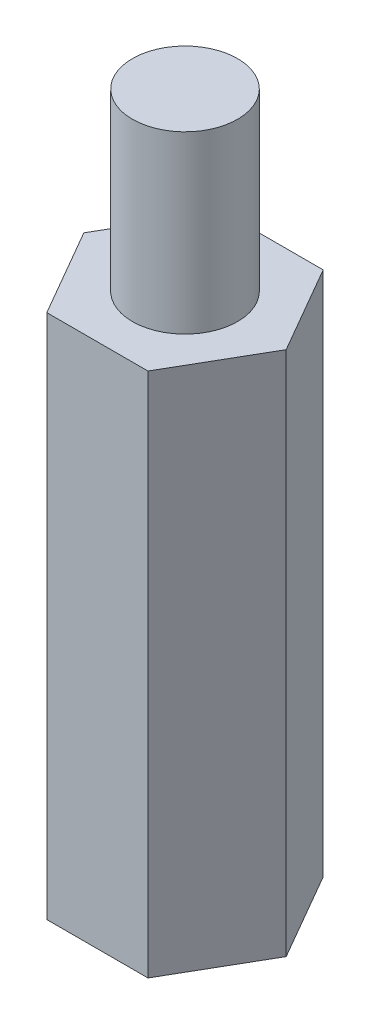
ISO-10303-21;
HEADER;
FILE_DESCRIPTION(('STEP AP214'),'2;1');
FILE_NAME('part.step','',(''),(''),'','','');
FILE_SCHEMA(('AUTOMOTIVE_DESIGN { 1 0 10303 214 1 1 1 1 }'));
ENDSEC;
DATA;
#1=APPLICATION_CONTEXT('core data for automotive mechanical design processes');
#2=APPLICATION_PROTOCOL_DEFINITION('international standard','automotive_design',2000,#1);
#3=PRODUCT_CONTEXT('',#1,'mechanical');
#4=PRODUCT('Part','Part','',(#3));
#5=PRODUCT_RELATED_PRODUCT_CATEGORY('part','',(#4));
#6=PRODUCT_DEFINITION_FORMATION('','',#4);
#7=PRODUCT_DEFINITION_CONTEXT('part definition',#1,'design');
#8=PRODUCT_DEFINITION('design','',#6,#7);
#9=PRODUCT_DEFINITION_SHAPE('','',#8);
#10=(LENGTH_UNIT() NAMED_UNIT(*) SI_UNIT(.MILLI.,.METRE.));
#11=(NAMED_UNIT(*) PLANE_ANGLE_UNIT() SI_UNIT($,.RADIAN.));
#12=(NAMED_UNIT(*) SI_UNIT($,.STERADIAN.) SOLID_ANGLE_UNIT());
#13=UNCERTAINTY_MEASURE_WITH_UNIT(LENGTH_MEASURE(1.E-05),#10,'distance_accuracy_value','');
#14=(GEOMETRIC_REPRESENTATION_CONTEXT(3) GLOBAL_UNCERTAINTY_ASSIGNED_CONTEXT((#13)) GLOBAL_UNIT_ASSIGNED_CONTEXT((#10,
#11,#12)) REPRESENTATION_CONTEXT('',''));
#15=CARTESIAN_POINT('',(0.,0.,0.));
#16=DIRECTION('',(0.,0.,1.));
#17=DIRECTION('',(1.,0.,0.));
#18=AXIS2_PLACEMENT_3D('',#15,#16,#17);
#19=CARTESIAN_POINT('',(1.44337567297409,15.,2.49999999999997));
#20=DIRECTION('',(-0.866025403784442,0.,-0.499999999999995));
#21=DIRECTION('',(-0.499999999999995,0.,0.866025403784442));
#22=AXIS2_PLACEMENT_3D('',#19,#20,#21);
#23=PLANE('',#22);
#24=DIRECTION('',(0.499999999999995,0.,-0.866025403784442));
#25=VECTOR('',#24,1.);
#26=CARTESIAN_POINT('',(1.44337567297409,0.,2.49999999999997));
#27=LINE('',#26,#25);
#28=CARTESIAN_POINT('',(1.44337567297409,0.,2.49999999999997));
#29=VERTEX_POINT('',#28);
#30=CARTESIAN_POINT('',(2.88675134594812,0.,0.));
#31=VERTEX_POINT('',#30);
#32=EDGE_CURVE('E119',#29,#31,#27,.T.);
#33=ORIENTED_EDGE('',*,*,#32,.T.);
#34=DIRECTION('',(0.,-1.,0.));
#35=VECTOR('',#34,1.);
#36=CARTESIAN_POINT('',(2.88675134594812,15.,0.));
#37=LINE('',#36,#35);
#38=CARTESIAN_POINT('',(2.88675134594812,15.,0.));
#39=VERTEX_POINT('',#38);
#40=EDGE_CURVE('E36',#39,#31,#37,.T.);
#41=ORIENTED_EDGE('',*,*,#40,.F.);
#42=DIRECTION('',(0.499999999999995,0.,-0.866025403784442));
#43=VECTOR('',#42,1.);
#44=CARTESIAN_POINT('',(1.44337567297409,15.,2.49999999999997));
#45=LINE('',#44,#43);
#46=CARTESIAN_POINT('',(1.44337567297409,15.,2.49999999999997));
#47=VERTEX_POINT('',#46);
#48=EDGE_CURVE('E130',#47,#39,#45,.T.);
#49=ORIENTED_EDGE('',*,*,#48,.F.);
#50=DIRECTION('',(0.,-1.,0.));
#51=VECTOR('',#50,1.);
#52=CARTESIAN_POINT('',(1.44337567297409,15.,2.49999999999997));
#53=LINE('',#52,#51);
#54=EDGE_CURVE('E115',#47,#29,#53,.T.);
#55=ORIENTED_EDGE('',*,*,#54,.T.);
#56=EDGE_LOOP('',(#33,#41,#49,#55));
#57=FACE_BOUND('',#56,.T.);
#58=ADVANCED_FACE('F33',(#57),#23,.F.);
#59=CARTESIAN_POINT('',(2.88675134594812,15.,0.));
#60=DIRECTION('',(-0.866025403784438,0.,0.500000000000001));
#61=DIRECTION('',(0.500000000000001,0.,0.866025403784438));
#62=AXIS2_PLACEMENT_3D('',#59,#60,#61);
#63=PLANE('',#62);
#64=DIRECTION('',(-0.500000000000001,0.,-0.866025403784438));
#65=VECTOR('',#64,1.);
#66=CARTESIAN_POINT('',(2.88675134594812,0.,0.));
#67=LINE('',#66,#65);
#68=CARTESIAN_POINT('',(1.44337567297405,0.,-2.49999999999999));
#69=VERTEX_POINT('',#68);
#70=EDGE_CURVE('E122',#31,#69,#67,.T.);
#71=ORIENTED_EDGE('',*,*,#70,.T.);
#72=DIRECTION('',(0.,-1.,0.));
#73=VECTOR('',#72,1.);
#74=CARTESIAN_POINT('',(1.44337567297405,15.,-2.49999999999999));
#75=LINE('',#74,#73);
#76=CARTESIAN_POINT('',(1.44337567297405,15.,-2.49999999999999));
#77=VERTEX_POINT('',#76);
#78=EDGE_CURVE('E133',#77,#69,#75,.T.);
#79=ORIENTED_EDGE('',*,*,#78,.F.);
#80=DIRECTION('',(-0.500000000000001,0.,-0.866025403784438));
#81=VECTOR('',#80,1.);
#82=CARTESIAN_POINT('',(2.88675134594812,15.,0.));
#83=LINE('',#82,#81);
#84=EDGE_CURVE('E88',#39,#77,#83,.T.);
#85=ORIENTED_EDGE('',*,*,#84,.F.);
#86=ORIENTED_EDGE('',*,*,#40,.T.);
#87=EDGE_LOOP('',(#71,#79,#85,#86));
#88=FACE_BOUND('',#87,.T.);
#89=ADVANCED_FACE('F138',(#88),#63,.F.);
#90=CARTESIAN_POINT('',(1.44337567297405,15.,-2.49999999999999));
#91=DIRECTION('',(0.,0.,1.));
#92=DIRECTION('',(1.,0.,0.));
#93=AXIS2_PLACEMENT_3D('',#90,#91,#92);
#94=PLANE('',#93);
#95=DIRECTION('',(-1.,0.,0.));
#96=VECTOR('',#95,1.);
#97=CARTESIAN_POINT('',(1.44337567297405,0.,-2.49999999999999));
#98=LINE('',#97,#96);
#99=CARTESIAN_POINT('',(-1.44337567297407,0.,-2.49999999999998));
#100=VERTEX_POINT('',#99);
#101=EDGE_CURVE('E125',#69,#100,#98,.T.);
#102=ORIENTED_EDGE('',*,*,#101,.T.);
#103=DIRECTION('',(0.,-1.,0.));
#104=VECTOR('',#103,1.);
#105=CARTESIAN_POINT('',(-1.44337567297407,15.,-2.49999999999998));
#106=LINE('',#105,#104);
#107=CARTESIAN_POINT('',(-1.44337567297407,15.,-2.49999999999998));
#108=VERTEX_POINT('',#107);
#109=EDGE_CURVE('E110',#108,#100,#106,.T.);
#110=ORIENTED_EDGE('',*,*,#109,.F.);
#111=DIRECTION('',(-1.,0.,0.));
#112=VECTOR('',#111,1.);
#113=CARTESIAN_POINT('',(1.44337567297405,15.,-2.49999999999999));
#114=LINE('',#113,#112);
#115=EDGE_CURVE('E101',#77,#108,#114,.T.);
#116=ORIENTED_EDGE('',*,*,#115,.F.);
#117=ORIENTED_EDGE('',*,*,#78,.T.);
#118=EDGE_LOOP('',(#102,#110,#116,#117));
#119=FACE_BOUND('',#118,.T.);
#120=ADVANCED_FACE('F144',(#119),#94,.F.);
#121=CARTESIAN_POINT('',(-1.44337567297407,15.,-2.49999999999998));
#122=DIRECTION('',(0.866025403784441,0.,0.499999999999995));
#123=DIRECTION('',(0.499999999999995,0.,-0.866025403784442));
#124=AXIS2_PLACEMENT_3D('',#121,#122,#123);
#125=PLANE('',#124);
#126=DIRECTION('',(-0.499999999999995,0.,0.866025403784442));
#127=VECTOR('',#126,1.);
#128=CARTESIAN_POINT('',(-1.44337567297407,0.,-2.49999999999998));
#129=LINE('',#128,#127);
#130=CARTESIAN_POINT('',(-2.88675134594812,0.,0.));
#131=VERTEX_POINT('',#130);
#132=EDGE_CURVE('E109',#100,#131,#129,.T.);
#133=ORIENTED_EDGE('',*,*,#132,.T.);
#134=DIRECTION('',(0.,-1.,0.));
#135=VECTOR('',#134,1.);
#136=CARTESIAN_POINT('',(-2.88675134594812,15.,0.));
#137=LINE('',#136,#135);
#138=CARTESIAN_POINT('',(-2.88675134594812,15.,0.));
#139=VERTEX_POINT('',#138);
#140=EDGE_CURVE('E106',#139,#131,#137,.T.);
#141=ORIENTED_EDGE('',*,*,#140,.F.);
#142=DIRECTION('',(-0.499999999999995,0.,0.866025403784442));
#143=VECTOR('',#142,1.);
#144=CARTESIAN_POINT('',(-1.44337567297407,15.,-2.49999999999998));
#145=LINE('',#144,#143);
#146=EDGE_CURVE('E95',#108,#139,#145,.T.);
#147=ORIENTED_EDGE('',*,*,#146,.F.);
#148=ORIENTED_EDGE('',*,*,#109,.T.);
#149=EDGE_LOOP('',(#133,#141,#147,#148));
#150=FACE_BOUND('',#149,.T.);
#151=ADVANCED_FACE('F107',(#150),#125,.F.);
#152=CARTESIAN_POINT('',(-2.88675134594812,15.,0.));
#153=DIRECTION('',(0.866025403784435,0.,-0.500000000000007));
#154=DIRECTION('',(-0.500000000000007,0.,-0.866025403784435));
#155=AXIS2_PLACEMENT_3D('',#152,#153,#154);
#156=PLANE('',#155);
#157=DIRECTION('',(0.500000000000007,0.,0.866025403784435));
#158=VECTOR('',#157,1.);
#159=CARTESIAN_POINT('',(-2.88675134594812,0.,0.));
#160=LINE('',#159,#158);
#161=CARTESIAN_POINT('',(-1.44337567297404,0.,2.5));
#162=VERTEX_POINT('',#161);
#163=EDGE_CURVE('E73',#131,#162,#160,.T.);
#164=ORIENTED_EDGE('',*,*,#163,.T.);
#165=DIRECTION('',(0.,-1.,0.));
#166=VECTOR('',#165,1.);
#167=CARTESIAN_POINT('',(-1.44337567297404,15.,2.5));
#168=LINE('',#167,#166);
#169=CARTESIAN_POINT('',(-1.44337567297404,15.,2.5));
#170=VERTEX_POINT('',#169);
#171=EDGE_CURVE('E111',#170,#162,#168,.T.);
#172=ORIENTED_EDGE('',*,*,#171,.F.);
#173=DIRECTION('',(0.500000000000007,0.,0.866025403784435));
#174=VECTOR('',#173,1.);
#175=CARTESIAN_POINT('',(-2.88675134594812,15.,0.));
#176=LINE('',#175,#174);
#177=EDGE_CURVE('E99',#139,#170,#176,.T.);
#178=ORIENTED_EDGE('',*,*,#177,.F.);
#179=ORIENTED_EDGE('',*,*,#140,.T.);
#180=EDGE_LOOP('',(#164,#172,#178,#179));
#181=FACE_BOUND('',#180,.T.);
#182=ADVANCED_FACE('F113',(#181),#156,.F.);
#183=CARTESIAN_POINT('',(-1.44337567297404,15.,2.5));
#184=DIRECTION('',(0.,0.,-1.));
#185=DIRECTION('',(-1.,0.,0.));
#186=AXIS2_PLACEMENT_3D('',#183,#184,#185);
#187=PLANE('',#186);
#188=DIRECTION('',(1.,0.,0.));
#189=VECTOR('',#188,1.);
#190=CARTESIAN_POINT('',(-1.44337567297404,0.,2.5));
#191=LINE('',#190,#189);
#192=EDGE_CURVE('E79',#162,#29,#191,.T.);
#193=ORIENTED_EDGE('',*,*,#192,.T.);
#194=ORIENTED_EDGE('',*,*,#54,.F.);
#195=DIRECTION('',(1.,0.,0.));
#196=VECTOR('',#195,1.);
#197=CARTESIAN_POINT('',(-1.44337567297404,15.,2.5));
#198=LINE('',#197,#196);
#199=EDGE_CURVE('E50',#170,#47,#198,.T.);
#200=ORIENTED_EDGE('',*,*,#199,.F.);
#201=ORIENTED_EDGE('',*,*,#171,.T.);
#202=EDGE_LOOP('',(#193,#194,#200,#201));
#203=FACE_BOUND('',#202,.T.);
#204=ADVANCED_FACE('F175',(#203),#187,.F.);
#205=CARTESIAN_POINT('',(0.,15.,0.));
#206=DIRECTION('',(0.,1.,0.));
#207=DIRECTION('',(0.,0.,1.));
#208=AXIS2_PLACEMENT_3D('',#205,#206,#207);
#209=PLANE('',#208);
#210=CARTESIAN_POINT('',(0.,15.,0.));
#211=DIRECTION('',(0.,1.,0.));
#212=DIRECTION('',(0.,0.,1.));
#213=AXIS2_PLACEMENT_3D('',#210,#211,#212);
#214=CIRCLE('',#213,1.5);
#215=CARTESIAN_POINT('',(0.,15.,1.5));
#216=VERTEX_POINT('',#215);
#217=EDGE_CURVE('E11',#216,#216,#214,.T.);
#218=ORIENTED_EDGE('',*,*,#217,.F.);
#219=EDGE_LOOP('',(#218));
#220=FACE_BOUND('',#219,.T.);
#221=ORIENTED_EDGE('',*,*,#48,.T.);
#222=ORIENTED_EDGE('',*,*,#84,.T.);
#223=ORIENTED_EDGE('',*,*,#115,.T.);
#224=ORIENTED_EDGE('',*,*,#146,.T.);
#225=ORIENTED_EDGE('',*,*,#177,.T.);
#226=ORIENTED_EDGE('',*,*,#199,.T.);
#227=EDGE_LOOP('',(#221,#222,#223,#224,#225,#226));
#228=FACE_BOUND('',#227,.T.);
#229=ADVANCED_FACE('F97',(#220,#228),#209,.T.);
#230=CARTESIAN_POINT('',(0.,0.,0.));
#231=DIRECTION('',(0.,1.,0.));
#232=DIRECTION('',(0.,0.,1.));
#233=AXIS2_PLACEMENT_3D('',#230,#231,#232);
#234=PLANE('',#233);
#235=CARTESIAN_POINT('',(0.,0.,0.));
#236=DIRECTION('',(0.,-1.,0.));
#237=DIRECTION('',(0.,0.,-1.));
#238=AXIS2_PLACEMENT_3D('',#235,#236,#237);
#239=CIRCLE('',#238,1.5);
#240=CARTESIAN_POINT('',(0.,0.,-1.5));
#241=VERTEX_POINT('',#240);
#242=EDGE_CURVE('E151',#241,#241,#239,.T.);
#243=ORIENTED_EDGE('',*,*,#242,.F.);
#244=EDGE_LOOP('',(#243));
#245=FACE_BOUND('',#244,.T.);
#246=ORIENTED_EDGE('',*,*,#32,.F.);
#247=ORIENTED_EDGE('',*,*,#192,.F.);
#248=ORIENTED_EDGE('',*,*,#163,.F.);
#249=ORIENTED_EDGE('',*,*,#132,.F.);
#250=ORIENTED_EDGE('',*,*,#101,.F.);
#251=ORIENTED_EDGE('',*,*,#70,.F.);
#252=EDGE_LOOP('',(#246,#247,#248,#249,#250,#251));
#253=FACE_BOUND('',#252,.T.);
#254=ADVANCED_FACE('F143',(#245,#253),#234,.F.);
#255=CARTESIAN_POINT('',(0.,20.,0.));
#256=DIRECTION('',(0.,-1.,0.));
#257=DIRECTION('',(0.,0.,-1.));
#258=AXIS2_PLACEMENT_3D('',#255,#256,#257);
#259=CYLINDRICAL_SURFACE('',#258,1.5);
#260=CARTESIAN_POINT('',(0.,20.,0.));
#261=DIRECTION('',(0.,1.,0.));
#262=DIRECTION('',(0.,0.,1.));
#263=AXIS2_PLACEMENT_3D('',#260,#261,#262);
#264=CIRCLE('',#263,1.5);
#265=CARTESIAN_POINT('',(0.,20.,1.5));
#266=VERTEX_POINT('',#265);
#267=EDGE_CURVE('E123',#266,#266,#264,.T.);
#268=ORIENTED_EDGE('',*,*,#267,.F.);
#269=EDGE_LOOP('',(#268));
#270=FACE_BOUND('',#269,.T.);
#271=ORIENTED_EDGE('',*,*,#217,.T.);
#272=EDGE_LOOP('',(#271));
#273=FACE_BOUND('',#272,.T.);
#274=ADVANCED_FACE('F167',(#270,#273),#259,.T.);
#275=CARTESIAN_POINT('',(0.,20.,0.));
#276=DIRECTION('',(0.,1.,0.));
#277=DIRECTION('',(0.,0.,1.));
#278=AXIS2_PLACEMENT_3D('',#275,#276,#277);
#279=PLANE('',#278);
#280=ORIENTED_EDGE('',*,*,#267,.T.);
#281=EDGE_LOOP('',(#280));
#282=FACE_BOUND('',#281,.T.);
#283=ADVANCED_FACE('F162',(#282),#279,.T.);
#284=CARTESIAN_POINT('',(0.,5.,0.));
#285=DIRECTION('',(0.,-1.,0.));
#286=DIRECTION('',(0.,0.,-1.));
#287=AXIS2_PLACEMENT_3D('',#284,#285,#286);
#288=CYLINDRICAL_SURFACE('',#287,1.5);
#289=CARTESIAN_POINT('',(0.,5.,0.));
#290=DIRECTION('',(0.,-1.,0.));
#291=DIRECTION('',(0.,0.,-1.));
#292=AXIS2_PLACEMENT_3D('',#289,#290,#291);
#293=CIRCLE('',#292,1.5);
#294=CARTESIAN_POINT('',(0.,5.,-1.5));
#295=VERTEX_POINT('',#294);
#296=EDGE_CURVE('E150',#295,#295,#293,.T.);
#297=ORIENTED_EDGE('',*,*,#296,.F.);
#298=EDGE_LOOP('',(#297));
#299=FACE_BOUND('',#298,.T.);
#300=ORIENTED_EDGE('',*,*,#242,.T.);
#301=EDGE_LOOP('',(#300));
#302=FACE_BOUND('',#301,.T.);
#303=ADVANCED_FACE('F159',(#299,#302),#288,.F.);
#304=CARTESIAN_POINT('',(0.,5.,0.));
#305=DIRECTION('',(0.,-1.,0.));
#306=DIRECTION('',(0.,0.,-1.));
#307=AXIS2_PLACEMENT_3D('',#304,#305,#306);
#308=PLANE('',#307);
#309=ORIENTED_EDGE('',*,*,#296,.T.);
#310=EDGE_LOOP('',(#309));
#311=FACE_BOUND('',#310,.T.);
#312=ADVANCED_FACE('F157',(#311),#308,.T.);
#313=CLOSED_SHELL('',(#58,#89,#120,#151,#182,#204,#229,#254,#274,#283,#303,#312));
#314=MANIFOLD_SOLID_BREP('B2',#313);
#315=ADVANCED_BREP_SHAPE_REPRESENTATION('',(#18,#314),#14);
#316=SHAPE_DEFINITION_REPRESENTATION(#9,#315);
ENDSEC;
END-ISO-10303-21;
